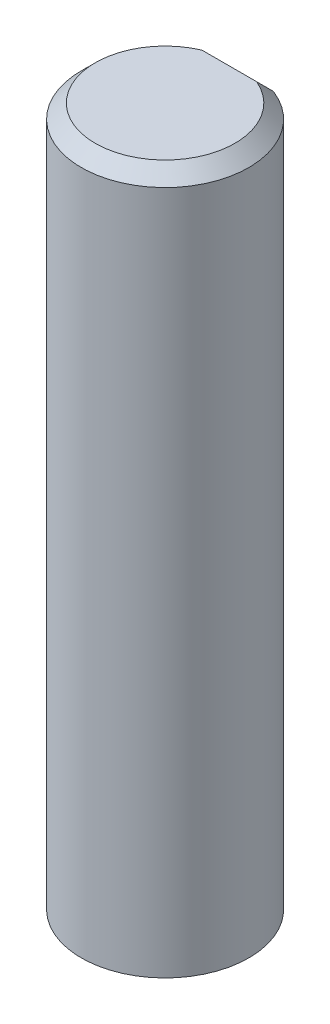
ISO-10303-21;
HEADER;
FILE_DESCRIPTION(('STEP AP214'),'2;1');
FILE_NAME('part.step','',(''),(''),'','','');
FILE_SCHEMA(('AUTOMOTIVE_DESIGN { 1 0 10303 214 1 1 1 1 }'));
ENDSEC;
DATA;
#1=APPLICATION_CONTEXT('core data for automotive mechanical design processes');
#2=APPLICATION_PROTOCOL_DEFINITION('international standard','automotive_design',2000,#1);
#3=PRODUCT_CONTEXT('',#1,'mechanical');
#4=PRODUCT('Part','Part','',(#3));
#5=PRODUCT_RELATED_PRODUCT_CATEGORY('part','',(#4));
#6=PRODUCT_DEFINITION_FORMATION('','',#4);
#7=PRODUCT_DEFINITION_CONTEXT('part definition',#1,'design');
#8=PRODUCT_DEFINITION('design','',#6,#7);
#9=PRODUCT_DEFINITION_SHAPE('','',#8);
#10=(LENGTH_UNIT() NAMED_UNIT(*) SI_UNIT(.MILLI.,.METRE.));
#11=(NAMED_UNIT(*) PLANE_ANGLE_UNIT() SI_UNIT($,.RADIAN.));
#12=(NAMED_UNIT(*) SI_UNIT($,.STERADIAN.) SOLID_ANGLE_UNIT());
#13=UNCERTAINTY_MEASURE_WITH_UNIT(LENGTH_MEASURE(1.E-05),#10,'distance_accuracy_value','');
#14=(GEOMETRIC_REPRESENTATION_CONTEXT(3) GLOBAL_UNCERTAINTY_ASSIGNED_CONTEXT((#13)) GLOBAL_UNIT_ASSIGNED_CONTEXT((#10,
#11,#12)) REPRESENTATION_CONTEXT('',''));
#15=CARTESIAN_POINT('',(0.,0.,0.));
#16=DIRECTION('',(0.,0.,1.));
#17=DIRECTION('',(1.,0.,0.));
#18=AXIS2_PLACEMENT_3D('',#15,#16,#17);
#19=CARTESIAN_POINT('',(0.,0.,0.));
#20=DIRECTION('',(0.,1.,0.));
#21=DIRECTION('',(0.,0.,1.));
#22=AXIS2_PLACEMENT_3D('',#19,#20,#21);
#23=CYLINDRICAL_SURFACE('',#22,3.);
#24=DIRECTION('',(0.,1.,0.));
#25=VECTOR('',#24,1.);
#26=CARTESIAN_POINT('',(1.0770329614269,0.,-2.8));
#27=LINE('',#26,#25);
#28=CARTESIAN_POINT('',(1.0770329614269,0.,-2.8));
#29=VERTEX_POINT('',#28);
#30=CARTESIAN_POINT('',(1.0770329614269,24.4999768229869,-2.8));
#31=VERTEX_POINT('',#30);
#32=EDGE_CURVE('E71',#29,#31,#27,.T.);
#33=ORIENTED_EDGE('',*,*,#32,.T.);
#34=CARTESIAN_POINT('',(0.,24.4999768229869,0.));
#35=DIRECTION('',(0.,1.,0.));
#36=DIRECTION('',(0.,0.,1.));
#37=AXIS2_PLACEMENT_3D('',#34,#35,#36);
#38=CIRCLE('',#37,3.);
#39=CARTESIAN_POINT('',(-1.0770329614269,24.4999768229869,-2.8));
#40=VERTEX_POINT('',#39);
#41=EDGE_CURVE('E46',#31,#40,#38,.F.);
#42=ORIENTED_EDGE('',*,*,#41,.T.);
#43=DIRECTION('',(0.,1.,0.));
#44=VECTOR('',#43,1.);
#45=CARTESIAN_POINT('',(-1.0770329614269,0.,-2.8));
#46=LINE('',#45,#44);
#47=CARTESIAN_POINT('',(-1.0770329614269,0.,-2.8));
#48=VERTEX_POINT('',#47);
#49=EDGE_CURVE('E78',#48,#40,#46,.T.);
#50=ORIENTED_EDGE('',*,*,#49,.F.);
#51=CARTESIAN_POINT('',(0.,0.,0.));
#52=DIRECTION('',(0.,1.,0.));
#53=DIRECTION('',(0.,0.,1.));
#54=AXIS2_PLACEMENT_3D('',#51,#52,#53);
#55=CIRCLE('',#54,3.);
#56=EDGE_CURVE('E81',#48,#29,#55,.T.);
#57=ORIENTED_EDGE('',*,*,#56,.T.);
#58=EDGE_LOOP('',(#33,#42,#50,#57));
#59=FACE_BOUND('',#58,.T.);
#60=ADVANCED_FACE('F33',(#59),#23,.T.);
#61=CARTESIAN_POINT('',(1.0770329614269,0.,-2.8));
#62=DIRECTION('',(0.,0.,-1.));
#63=DIRECTION('',(-1.,0.,0.));
#64=AXIS2_PLACEMENT_3D('',#61,#62,#63);
#65=PLANE('',#64);
#66=ORIENTED_EDGE('',*,*,#49,.T.);
#67=DIRECTION('',(1.,0.,0.));
#68=VECTOR('',#67,1.);
#69=CARTESIAN_POINT('',(1.0770329614269,24.4999768229869,-2.8));
#70=LINE('',#69,#68);
#71=EDGE_CURVE('E11',#40,#31,#70,.T.);
#72=ORIENTED_EDGE('',*,*,#71,.T.);
#73=ORIENTED_EDGE('',*,*,#32,.F.);
#74=DIRECTION('',(-1.,0.,0.));
#75=VECTOR('',#74,1.);
#76=CARTESIAN_POINT('',(1.0770329614269,0.,-2.8));
#77=LINE('',#76,#75);
#78=EDGE_CURVE('E75',#29,#48,#77,.T.);
#79=ORIENTED_EDGE('',*,*,#78,.T.);
#80=EDGE_LOOP('',(#66,#72,#73,#79));
#81=FACE_BOUND('',#80,.T.);
#82=ADVANCED_FACE('F73',(#81),#65,.T.);
#83=CARTESIAN_POINT('',(0.,0.,0.));
#84=DIRECTION('',(0.,1.,0.));
#85=DIRECTION('',(0.,0.,1.));
#86=AXIS2_PLACEMENT_3D('',#83,#84,#85);
#87=PLANE('',#86);
#88=ORIENTED_EDGE('',*,*,#56,.F.);
#89=ORIENTED_EDGE('',*,*,#78,.F.);
#90=EDGE_LOOP('',(#88,#89));
#91=FACE_BOUND('',#90,.T.);
#92=ADVANCED_FACE('F84',(#91),#87,.F.);
#93=CARTESIAN_POINT('',(0.,25.,0.));
#94=DIRECTION('',(0.,1.,0.));
#95=DIRECTION('',(0.,0.,1.));
#96=AXIS2_PLACEMENT_3D('',#93,#94,#95);
#97=PLANE('',#96);
#98=DIRECTION('',(-1.,0.,0.));
#99=VECTOR('',#98,1.);
#100=CARTESIAN_POINT('',(0.,25.,-2.29997270053647));
#101=LINE('',#100,#99);
#102=CARTESIAN_POINT('',(0.979790324617764,25.,-2.29997270053647));
#103=VERTEX_POINT('',#102);
#104=CARTESIAN_POINT('',(-0.979790324617764,25.,-2.29997270053647));
#105=VERTEX_POINT('',#104);
#106=EDGE_CURVE('E87',#103,#105,#101,.T.);
#107=ORIENTED_EDGE('',*,*,#106,.T.);
#108=CARTESIAN_POINT('',(0.,25.,0.));
#109=DIRECTION('',(0.,1.,0.));
#110=DIRECTION('',(0.,0.,1.));
#111=AXIS2_PLACEMENT_3D('',#108,#109,#110);
#112=CIRCLE('',#111,2.49997270053647);
#113=EDGE_CURVE('E90',#105,#103,#112,.T.);
#114=ORIENTED_EDGE('',*,*,#113,.T.);
#115=EDGE_LOOP('',(#107,#114));
#116=FACE_BOUND('',#115,.T.);
#117=ADVANCED_FACE('F101',(#116),#97,.T.);
#118=CARTESIAN_POINT('',(0.,25.,-2.29997270053647));
#119=DIRECTION('',(0.,-0.707109696046034,0.707103866315045));
#120=DIRECTION('',(-1.,0.,0.));
#121=AXIS2_PLACEMENT_3D('',#118,#119,#120);
#122=PLANE('',#121);
#123=CARTESIAN_POINT('',(0.979790324617764,25.,-2.29997270053647));
#124=CARTESIAN_POINT('',(0.996749061820663,24.9167358118636,-2.38323757514599));
#125=CARTESIAN_POINT('',(1.01333199063932,24.833435081125,-2.46653899265903));
#126=CARTESIAN_POINT('',(1.04574620151823,24.6667606886521,-2.63321475928211));
#127=CARTESIAN_POINT('',(1.06157748496928,24.583387027053,-2.71658910825692));
#128=CARTESIAN_POINT('',(1.0770329614269,24.4999768229869,-2.8));
#129=B_SPLINE_CURVE_WITH_KNOTS('',3,(#123,#124,#125,#126,#127,#128),.UNSPECIFIED.,.F.,.F.,(4,2,
4),(0.,0.35690080255618,0.71380094469696),.UNSPECIFIED.);
#130=EDGE_CURVE('E93',#31,#103,#129,.F.);
#131=ORIENTED_EDGE('',*,*,#130,.F.);
#132=ORIENTED_EDGE('',*,*,#71,.F.);
#133=CARTESIAN_POINT('',(-1.0770329614269,24.4999768229869,-2.8));
#134=CARTESIAN_POINT('',(-1.06157748496928,24.583387027053,-2.71658910825692));
#135=CARTESIAN_POINT('',(-1.04574620151823,24.6667606886521,-2.63321475928211));
#136=CARTESIAN_POINT('',(-1.01333199063932,24.833435081125,-2.46653899265903));
#137=CARTESIAN_POINT('',(-0.996749061820664,24.9167358118636,-2.38323757514599));
#138=CARTESIAN_POINT('',(-0.979790324617765,25.,-2.29997270053647));
#139=B_SPLINE_CURVE_WITH_KNOTS('',3,(#133,#134,#135,#136,#137,#138),.UNSPECIFIED.,.F.,.F.,(4,2,
4),(0.,0.35690014214078,0.713800944696959),.UNSPECIFIED.);
#140=EDGE_CURVE('E38',#105,#40,#139,.F.);
#141=ORIENTED_EDGE('',*,*,#140,.F.);
#142=ORIENTED_EDGE('',*,*,#106,.F.);
#143=EDGE_LOOP('',(#131,#132,#141,#142));
#144=FACE_BOUND('',#143,.T.);
#145=ADVANCED_FACE('F97',(#144),#122,.F.);
#146=CARTESIAN_POINT('',(0.,25.,0.));
#147=DIRECTION('',(0.,-1.,0.));
#148=DIRECTION('',(0.,0.,-1.));
#149=AXIS2_PLACEMENT_3D('',#146,#147,#148);
#150=CONICAL_SURFACE('',#149,2.49997270053647,0.785402285639763);
#151=ORIENTED_EDGE('',*,*,#140,.T.);
#152=ORIENTED_EDGE('',*,*,#41,.F.);
#153=ORIENTED_EDGE('',*,*,#130,.T.);
#154=ORIENTED_EDGE('',*,*,#113,.F.);
#155=EDGE_LOOP('',(#151,#152,#153,#154));
#156=FACE_BOUND('',#155,.T.);
#157=ADVANCED_FACE('F35',(#156),#150,.T.);
#158=CLOSED_SHELL('',(#60,#82,#92,#117,#145,#157));
#159=MANIFOLD_SOLID_BREP('B2',#158);
#160=ADVANCED_BREP_SHAPE_REPRESENTATION('',(#18,#159),#14);
#161=SHAPE_DEFINITION_REPRESENTATION(#9,#160);
ENDSEC;
END-ISO-10303-21;
